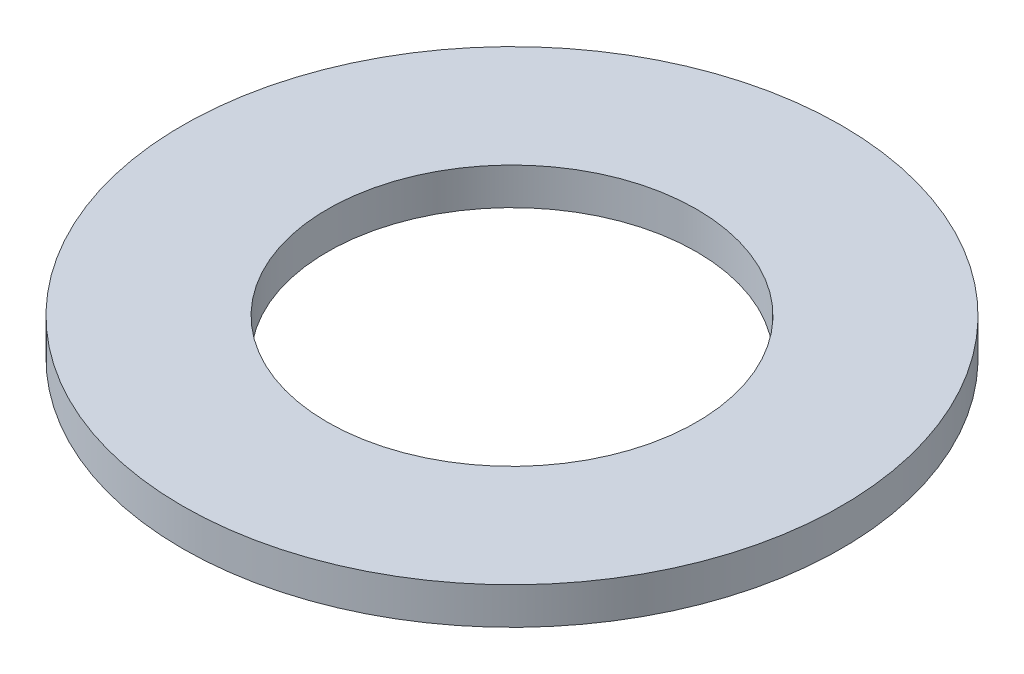
ISO-10303-21;
HEADER;
FILE_DESCRIPTION(('STEP AP214'),'2;1');
FILE_NAME('part.step','',(''),(''),'','','');
FILE_SCHEMA(('AUTOMOTIVE_DESIGN { 1 0 10303 214 1 1 1 1 }'));
ENDSEC;
DATA;
#1=APPLICATION_CONTEXT('core data for automotive mechanical design processes');
#2=APPLICATION_PROTOCOL_DEFINITION('international standard','automotive_design',2000,#1);
#3=PRODUCT_CONTEXT('',#1,'mechanical');
#4=PRODUCT('Part','Part','',(#3));
#5=PRODUCT_RELATED_PRODUCT_CATEGORY('part','',(#4));
#6=PRODUCT_DEFINITION_FORMATION('','',#4);
#7=PRODUCT_DEFINITION_CONTEXT('part definition',#1,'design');
#8=PRODUCT_DEFINITION('design','',#6,#7);
#9=PRODUCT_DEFINITION_SHAPE('','',#8);
#10=(LENGTH_UNIT() NAMED_UNIT(*) SI_UNIT(.MILLI.,.METRE.));
#11=(NAMED_UNIT(*) PLANE_ANGLE_UNIT() SI_UNIT($,.RADIAN.));
#12=(NAMED_UNIT(*) SI_UNIT($,.STERADIAN.) SOLID_ANGLE_UNIT());
#13=UNCERTAINTY_MEASURE_WITH_UNIT(LENGTH_MEASURE(1.E-05),#10,'distance_accuracy_value','');
#14=(GEOMETRIC_REPRESENTATION_CONTEXT(3) GLOBAL_UNCERTAINTY_ASSIGNED_CONTEXT((#13)) GLOBAL_UNIT_ASSIGNED_CONTEXT((#10,
#11,#12)) REPRESENTATION_CONTEXT('',''));
#15=CARTESIAN_POINT('',(0.,0.,0.));
#16=DIRECTION('',(0.,0.,1.));
#17=DIRECTION('',(1.,0.,0.));
#18=AXIS2_PLACEMENT_3D('',#15,#16,#17);
#19=CARTESIAN_POINT('',(0.,7.,0.));
#20=DIRECTION('',(0.,-1.,0.));
#21=DIRECTION('',(0.,0.,-1.));
#22=AXIS2_PLACEMENT_3D('',#19,#20,#21);
#23=CYLINDRICAL_SURFACE('',#22,62.5);
#24=CARTESIAN_POINT('',(0.,7.,0.));
#25=DIRECTION('',(0.,1.,0.));
#26=DIRECTION('',(0.,0.,1.));
#27=AXIS2_PLACEMENT_3D('',#24,#25,#26);
#28=CIRCLE('',#27,62.5);
#29=CARTESIAN_POINT('',(0.,7.,62.5));
#30=VERTEX_POINT('',#29);
#31=EDGE_CURVE('E10',#30,#30,#28,.T.);
#32=ORIENTED_EDGE('',*,*,#31,.F.);
#33=EDGE_LOOP('',(#32));
#34=FACE_BOUND('',#33,.T.);
#35=CARTESIAN_POINT('',(0.,0.,0.));
#36=DIRECTION('',(0.,1.,0.));
#37=DIRECTION('',(0.,0.,1.));
#38=AXIS2_PLACEMENT_3D('',#35,#36,#37);
#39=CIRCLE('',#38,62.5);
#40=CARTESIAN_POINT('',(0.,0.,62.5));
#41=VERTEX_POINT('',#40);
#42=EDGE_CURVE('E37',#41,#41,#39,.T.);
#43=ORIENTED_EDGE('',*,*,#42,.T.);
#44=EDGE_LOOP('',(#43));
#45=FACE_BOUND('',#44,.T.);
#46=ADVANCED_FACE('F40',(#34,#45),#23,.T.);
#47=CARTESIAN_POINT('',(0.,7.,0.));
#48=DIRECTION('',(0.,1.,0.));
#49=DIRECTION('',(0.,0.,1.));
#50=AXIS2_PLACEMENT_3D('',#47,#48,#49);
#51=PLANE('',#50);
#52=CARTESIAN_POINT('',(0.,7.,0.));
#53=DIRECTION('',(0.,1.,0.));
#54=DIRECTION('',(0.,0.,1.));
#55=AXIS2_PLACEMENT_3D('',#52,#53,#54);
#56=CIRCLE('',#55,35.);
#57=CARTESIAN_POINT('',(0.,7.,35.));
#58=VERTEX_POINT('',#57);
#59=EDGE_CURVE('E50',#58,#58,#56,.T.);
#60=ORIENTED_EDGE('',*,*,#59,.F.);
#61=EDGE_LOOP('',(#60));
#62=FACE_BOUND('',#61,.T.);
#63=ORIENTED_EDGE('',*,*,#31,.T.);
#64=EDGE_LOOP('',(#63));
#65=FACE_BOUND('',#64,.T.);
#66=ADVANCED_FACE('F59',(#62,#65),#51,.T.);
#67=CARTESIAN_POINT('',(0.,0.,0.));
#68=DIRECTION('',(0.,1.,0.));
#69=DIRECTION('',(0.,0.,1.));
#70=AXIS2_PLACEMENT_3D('',#67,#68,#69);
#71=PLANE('',#70);
#72=CARTESIAN_POINT('',(0.,0.,0.));
#73=DIRECTION('',(0.,1.,0.));
#74=DIRECTION('',(0.,0.,1.));
#75=AXIS2_PLACEMENT_3D('',#72,#73,#74);
#76=CIRCLE('',#75,35.);
#77=CARTESIAN_POINT('',(0.,0.,35.));
#78=VERTEX_POINT('',#77);
#79=EDGE_CURVE('E47',#78,#78,#76,.T.);
#80=ORIENTED_EDGE('',*,*,#79,.T.);
#81=EDGE_LOOP('',(#80));
#82=FACE_BOUND('',#81,.T.);
#83=ORIENTED_EDGE('',*,*,#42,.F.);
#84=EDGE_LOOP('',(#83));
#85=FACE_BOUND('',#84,.T.);
#86=ADVANCED_FACE('F58',(#82,#85),#71,.F.);
#87=CARTESIAN_POINT('',(0.,7.,0.));
#88=DIRECTION('',(0.,-1.,0.));
#89=DIRECTION('',(0.,0.,-1.));
#90=AXIS2_PLACEMENT_3D('',#87,#88,#89);
#91=CYLINDRICAL_SURFACE('',#90,35.);
#92=ORIENTED_EDGE('',*,*,#59,.T.);
#93=EDGE_LOOP('',(#92));
#94=FACE_BOUND('',#93,.T.);
#95=ORIENTED_EDGE('',*,*,#79,.F.);
#96=EDGE_LOOP('',(#95));
#97=FACE_BOUND('',#96,.T.);
#98=ADVANCED_FACE('F54',(#94,#97),#91,.F.);
#99=CLOSED_SHELL('',(#46,#66,#86,#98));
#100=MANIFOLD_SOLID_BREP('B2',#99);
#101=ADVANCED_BREP_SHAPE_REPRESENTATION('',(#18,#100),#14);
#102=SHAPE_DEFINITION_REPRESENTATION(#9,#101);
ENDSEC;
END-ISO-10303-21;
